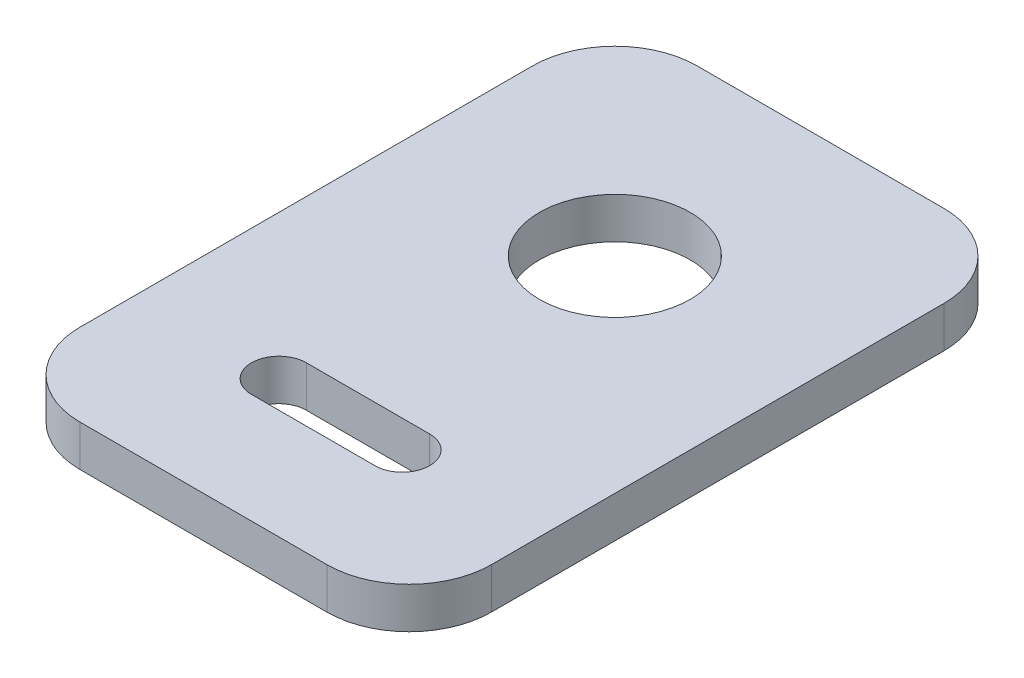
ISO-10303-21;
HEADER;
FILE_DESCRIPTION(('STEP AP214'),'2;1');
FILE_NAME('part.step','',(''),(''),'','','');
FILE_SCHEMA(('AUTOMOTIVE_DESIGN { 1 0 10303 214 1 1 1 1 }'));
ENDSEC;
DATA;
#1=APPLICATION_CONTEXT('core data for automotive mechanical design processes');
#2=APPLICATION_PROTOCOL_DEFINITION('international standard','automotive_design',2000,#1);
#3=PRODUCT_CONTEXT('',#1,'mechanical');
#4=PRODUCT('Part','Part','',(#3));
#5=PRODUCT_RELATED_PRODUCT_CATEGORY('part','',(#4));
#6=PRODUCT_DEFINITION_FORMATION('','',#4);
#7=PRODUCT_DEFINITION_CONTEXT('part definition',#1,'design');
#8=PRODUCT_DEFINITION('design','',#6,#7);
#9=PRODUCT_DEFINITION_SHAPE('','',#8);
#10=(LENGTH_UNIT() NAMED_UNIT(*) SI_UNIT(.MILLI.,.METRE.));
#11=(NAMED_UNIT(*) PLANE_ANGLE_UNIT() SI_UNIT($,.RADIAN.));
#12=(NAMED_UNIT(*) SI_UNIT($,.STERADIAN.) SOLID_ANGLE_UNIT());
#13=UNCERTAINTY_MEASURE_WITH_UNIT(LENGTH_MEASURE(1.E-05),#10,'distance_accuracy_value','');
#14=(GEOMETRIC_REPRESENTATION_CONTEXT(3) GLOBAL_UNCERTAINTY_ASSIGNED_CONTEXT((#13)) GLOBAL_UNIT_ASSIGNED_CONTEXT((#10,
#11,#12)) REPRESENTATION_CONTEXT('',''));
#15=CARTESIAN_POINT('',(0.,0.,0.));
#16=DIRECTION('',(0.,0.,1.));
#17=DIRECTION('',(1.,0.,0.));
#18=AXIS2_PLACEMENT_3D('',#15,#16,#17);
#19=CARTESIAN_POINT('',(0.,1.5,0.));
#20=DIRECTION('',(0.,1.,0.));
#21=DIRECTION('',(0.,0.,1.));
#22=AXIS2_PLACEMENT_3D('',#19,#20,#21);
#23=PLANE('',#22);
#24=DIRECTION('',(1.,0.,0.));
#25=VECTOR('',#24,1.);
#26=CARTESIAN_POINT('',(-2.25,1.5,11.));
#27=LINE('',#26,#25);
#28=CARTESIAN_POINT('',(2.25,1.5,11.));
#29=VERTEX_POINT('',#28);
#30=CARTESIAN_POINT('',(-2.25,1.5,11.));
#31=VERTEX_POINT('',#30);
#32=EDGE_CURVE('E160',#29,#31,#27,.F.);
#33=ORIENTED_EDGE('',*,*,#32,.T.);
#34=CARTESIAN_POINT('',(-2.25,1.5,10.));
#35=DIRECTION('',(0.,1.,0.));
#36=DIRECTION('',(0.,0.,1.));
#37=AXIS2_PLACEMENT_3D('',#34,#35,#36);
#38=CIRCLE('',#37,1.);
#39=CARTESIAN_POINT('',(-2.25,1.5,9.));
#40=VERTEX_POINT('',#39);
#41=EDGE_CURVE('E215',#31,#40,#38,.F.);
#42=ORIENTED_EDGE('',*,*,#41,.T.);
#43=DIRECTION('',(-1.,0.,0.));
#44=VECTOR('',#43,1.);
#45=CARTESIAN_POINT('',(2.25,1.5,9.));
#46=LINE('',#45,#44);
#47=CARTESIAN_POINT('',(2.25,1.5,9.));
#48=VERTEX_POINT('',#47);
#49=EDGE_CURVE('E165',#40,#48,#46,.F.);
#50=ORIENTED_EDGE('',*,*,#49,.T.);
#51=CARTESIAN_POINT('',(2.25,1.5,10.));
#52=DIRECTION('',(0.,1.,0.));
#53=DIRECTION('',(0.,0.,1.));
#54=AXIS2_PLACEMENT_3D('',#51,#52,#53);
#55=CIRCLE('',#54,1.);
#56=EDGE_CURVE('E212',#48,#29,#55,.F.);
#57=ORIENTED_EDGE('',*,*,#56,.T.);
#58=EDGE_LOOP('',(#33,#42,#50,#57));
#59=FACE_BOUND('',#58,.T.);
#60=CARTESIAN_POINT('',(0.,1.5,0.));
#61=DIRECTION('',(0.,1.,0.));
#62=DIRECTION('',(0.,0.,1.));
#63=AXIS2_PLACEMENT_3D('',#60,#61,#62);
#64=CIRCLE('',#63,2.75);
#65=CARTESIAN_POINT('',(0.,1.5,2.75));
#66=VERTEX_POINT('',#65);
#67=EDGE_CURVE('E218',#66,#66,#64,.F.);
#68=ORIENTED_EDGE('',*,*,#67,.T.);
#69=EDGE_LOOP('',(#68));
#70=FACE_BOUND('',#69,.T.);
#71=DIRECTION('',(1.,0.,0.));
#72=VECTOR('',#71,1.);
#73=CARTESIAN_POINT('',(-7.5,1.5,15.));
#74=LINE('',#73,#72);
#75=CARTESIAN_POINT('',(4.5,1.5,15.));
#76=VERTEX_POINT('',#75);
#77=CARTESIAN_POINT('',(-4.5,1.5,15.));
#78=VERTEX_POINT('',#77);
#79=EDGE_CURVE('E143',#76,#78,#74,.F.);
#80=ORIENTED_EDGE('',*,*,#79,.F.);
#81=CARTESIAN_POINT('',(4.5,1.5,12.));
#82=DIRECTION('',(0.,-1.,0.));
#83=DIRECTION('',(0.,0.,-1.));
#84=AXIS2_PLACEMENT_3D('',#81,#82,#83);
#85=CIRCLE('',#84,3.);
#86=CARTESIAN_POINT('',(7.5,1.5,12.));
#87=VERTEX_POINT('',#86);
#88=EDGE_CURVE('E20',#87,#76,#85,.T.);
#89=ORIENTED_EDGE('',*,*,#88,.F.);
#90=DIRECTION('',(0.,0.,-1.));
#91=VECTOR('',#90,1.);
#92=CARTESIAN_POINT('',(7.5,1.5,15.));
#93=LINE('',#92,#91);
#94=CARTESIAN_POINT('',(7.5,1.5,-4.5));
#95=VERTEX_POINT('',#94);
#96=EDGE_CURVE('E128',#95,#87,#93,.F.);
#97=ORIENTED_EDGE('',*,*,#96,.F.);
#98=CARTESIAN_POINT('',(4.5,1.5,-4.5));
#99=DIRECTION('',(0.,-1.,0.));
#100=DIRECTION('',(0.,0.,-1.));
#101=AXIS2_PLACEMENT_3D('',#98,#99,#100);
#102=CIRCLE('',#101,3.);
#103=CARTESIAN_POINT('',(4.5,1.5,-7.5));
#104=VERTEX_POINT('',#103);
#105=EDGE_CURVE('E152',#104,#95,#102,.T.);
#106=ORIENTED_EDGE('',*,*,#105,.F.);
#107=DIRECTION('',(-1.,0.,0.));
#108=VECTOR('',#107,1.);
#109=CARTESIAN_POINT('',(7.5,1.5,-7.5));
#110=LINE('',#109,#108);
#111=CARTESIAN_POINT('',(-4.5,1.5,-7.5));
#112=VERTEX_POINT('',#111);
#113=EDGE_CURVE('E179',#112,#104,#110,.F.);
#114=ORIENTED_EDGE('',*,*,#113,.F.);
#115=CARTESIAN_POINT('',(-4.5,1.5,-4.5));
#116=DIRECTION('',(0.,-1.,0.));
#117=DIRECTION('',(0.,0.,-1.));
#118=AXIS2_PLACEMENT_3D('',#115,#116,#117);
#119=CIRCLE('',#118,3.);
#120=CARTESIAN_POINT('',(-7.5,1.5,-4.5));
#121=VERTEX_POINT('',#120);
#122=EDGE_CURVE('E226',#121,#112,#119,.T.);
#123=ORIENTED_EDGE('',*,*,#122,.F.);
#124=DIRECTION('',(0.,0.,1.));
#125=VECTOR('',#124,1.);
#126=CARTESIAN_POINT('',(-7.5,1.5,-7.5));
#127=LINE('',#126,#125);
#128=CARTESIAN_POINT('',(-7.5,1.5,12.));
#129=VERTEX_POINT('',#128);
#130=EDGE_CURVE('E174',#129,#121,#127,.F.);
#131=ORIENTED_EDGE('',*,*,#130,.F.);
#132=CARTESIAN_POINT('',(-4.5,1.5,12.));
#133=DIRECTION('',(0.,-1.,0.));
#134=DIRECTION('',(0.,0.,-1.));
#135=AXIS2_PLACEMENT_3D('',#132,#133,#134);
#136=CIRCLE('',#135,3.);
#137=EDGE_CURVE('E223',#78,#129,#136,.T.);
#138=ORIENTED_EDGE('',*,*,#137,.F.);
#139=EDGE_LOOP('',(#80,#89,#97,#106,#114,#123,#131,#138));
#140=FACE_BOUND('',#139,.T.);
#141=ADVANCED_FACE('F17',(#59,#70,#140),#23,.T.);
#142=CARTESIAN_POINT('',(4.5,5.259,12.));
#143=DIRECTION('',(0.,-1.,0.));
#144=DIRECTION('',(0.,0.,-1.));
#145=AXIS2_PLACEMENT_3D('',#142,#143,#144);
#146=CYLINDRICAL_SURFACE('',#145,3.);
#147=DIRECTION('',(0.,1.,0.));
#148=VECTOR('',#147,1.);
#149=CARTESIAN_POINT('',(4.5,0.,15.));
#150=LINE('',#149,#148);
#151=CARTESIAN_POINT('',(4.5,0.,15.));
#152=VERTEX_POINT('',#151);
#153=EDGE_CURVE('E222',#152,#76,#150,.T.);
#154=ORIENTED_EDGE('',*,*,#153,.F.);
#155=CARTESIAN_POINT('',(4.5,0.,12.));
#156=DIRECTION('',(0.,-1.,0.));
#157=DIRECTION('',(0.,0.,-1.));
#158=AXIS2_PLACEMENT_3D('',#155,#156,#157);
#159=CIRCLE('',#158,3.);
#160=CARTESIAN_POINT('',(7.5,0.,12.));
#161=VERTEX_POINT('',#160);
#162=EDGE_CURVE('E150',#152,#161,#159,.F.);
#163=ORIENTED_EDGE('',*,*,#162,.T.);
#164=DIRECTION('',(0.,1.,0.));
#165=VECTOR('',#164,1.);
#166=CARTESIAN_POINT('',(7.5,0.,12.));
#167=LINE('',#166,#165);
#168=EDGE_CURVE('E133',#87,#161,#167,.F.);
#169=ORIENTED_EDGE('',*,*,#168,.F.);
#170=ORIENTED_EDGE('',*,*,#88,.T.);
#171=EDGE_LOOP('',(#154,#163,#169,#170));
#172=FACE_BOUND('',#171,.T.);
#173=ADVANCED_FACE('F149',(#172),#146,.T.);
#174=CARTESIAN_POINT('',(7.5,0.,15.));
#175=DIRECTION('',(1.,0.,0.));
#176=DIRECTION('',(0.,0.,-1.));
#177=AXIS2_PLACEMENT_3D('',#174,#175,#176);
#178=PLANE('',#177);
#179=ORIENTED_EDGE('',*,*,#96,.T.);
#180=ORIENTED_EDGE('',*,*,#168,.T.);
#181=DIRECTION('',(0.,0.,1.));
#182=VECTOR('',#181,1.);
#183=CARTESIAN_POINT('',(7.5,0.,0.));
#184=LINE('',#183,#182);
#185=CARTESIAN_POINT('',(7.5,0.,-4.5));
#186=VERTEX_POINT('',#185);
#187=EDGE_CURVE('E209',#161,#186,#184,.F.);
#188=ORIENTED_EDGE('',*,*,#187,.T.);
#189=DIRECTION('',(0.,-1.,0.));
#190=VECTOR('',#189,1.);
#191=CARTESIAN_POINT('',(7.5,5.259,-4.5));
#192=LINE('',#191,#190);
#193=EDGE_CURVE('E135',#95,#186,#192,.T.);
#194=ORIENTED_EDGE('',*,*,#193,.F.);
#195=EDGE_LOOP('',(#179,#180,#188,#194));
#196=FACE_BOUND('',#195,.T.);
#197=ADVANCED_FACE('F130',(#196),#178,.T.);
#198=CARTESIAN_POINT('',(4.5,5.259,-4.5));
#199=DIRECTION('',(0.,-1.,0.));
#200=DIRECTION('',(0.,0.,-1.));
#201=AXIS2_PLACEMENT_3D('',#198,#199,#200);
#202=CYLINDRICAL_SURFACE('',#201,3.);
#203=ORIENTED_EDGE('',*,*,#193,.T.);
#204=CARTESIAN_POINT('',(4.5,0.,-4.5));
#205=DIRECTION('',(0.,-1.,0.));
#206=DIRECTION('',(0.,0.,-1.));
#207=AXIS2_PLACEMENT_3D('',#204,#205,#206);
#208=CIRCLE('',#207,3.);
#209=CARTESIAN_POINT('',(4.5,0.,-7.5));
#210=VERTEX_POINT('',#209);
#211=EDGE_CURVE('E205',#186,#210,#208,.F.);
#212=ORIENTED_EDGE('',*,*,#211,.T.);
#213=DIRECTION('',(0.,1.,0.));
#214=VECTOR('',#213,1.);
#215=CARTESIAN_POINT('',(4.5,0.,-7.5));
#216=LINE('',#215,#214);
#217=EDGE_CURVE('E181',#104,#210,#216,.F.);
#218=ORIENTED_EDGE('',*,*,#217,.F.);
#219=ORIENTED_EDGE('',*,*,#105,.T.);
#220=EDGE_LOOP('',(#203,#212,#218,#219));
#221=FACE_BOUND('',#220,.T.);
#222=ADVANCED_FACE('F315',(#221),#202,.T.);
#223=CARTESIAN_POINT('',(7.5,0.,-7.5));
#224=DIRECTION('',(0.,0.,-1.));
#225=DIRECTION('',(-1.,0.,0.));
#226=AXIS2_PLACEMENT_3D('',#223,#224,#225);
#227=PLANE('',#226);
#228=ORIENTED_EDGE('',*,*,#113,.T.);
#229=ORIENTED_EDGE('',*,*,#217,.T.);
#230=DIRECTION('',(1.,0.,0.));
#231=VECTOR('',#230,1.);
#232=CARTESIAN_POINT('',(0.,0.,-7.5));
#233=LINE('',#232,#231);
#234=CARTESIAN_POINT('',(-4.5,0.,-7.5));
#235=VERTEX_POINT('',#234);
#236=EDGE_CURVE('E204',#210,#235,#233,.F.);
#237=ORIENTED_EDGE('',*,*,#236,.T.);
#238=DIRECTION('',(0.,-1.,0.));
#239=VECTOR('',#238,1.);
#240=CARTESIAN_POINT('',(-4.5,5.259,-7.5));
#241=LINE('',#240,#239);
#242=EDGE_CURVE('E178',#112,#235,#241,.T.);
#243=ORIENTED_EDGE('',*,*,#242,.F.);
#244=EDGE_LOOP('',(#228,#229,#237,#243));
#245=FACE_BOUND('',#244,.T.);
#246=ADVANCED_FACE('F313',(#245),#227,.T.);
#247=CARTESIAN_POINT('',(-4.5,5.259,-4.5));
#248=DIRECTION('',(0.,-1.,0.));
#249=DIRECTION('',(0.,0.,-1.));
#250=AXIS2_PLACEMENT_3D('',#247,#248,#249);
#251=CYLINDRICAL_SURFACE('',#250,3.);
#252=ORIENTED_EDGE('',*,*,#242,.T.);
#253=CARTESIAN_POINT('',(-4.5,0.,-4.5));
#254=DIRECTION('',(0.,-1.,0.));
#255=DIRECTION('',(0.,0.,-1.));
#256=AXIS2_PLACEMENT_3D('',#253,#254,#255);
#257=CIRCLE('',#256,3.);
#258=CARTESIAN_POINT('',(-7.5,0.,-4.5));
#259=VERTEX_POINT('',#258);
#260=EDGE_CURVE('E200',#235,#259,#257,.F.);
#261=ORIENTED_EDGE('',*,*,#260,.T.);
#262=DIRECTION('',(0.,1.,0.));
#263=VECTOR('',#262,1.);
#264=CARTESIAN_POINT('',(-7.5,0.,-4.5));
#265=LINE('',#264,#263);
#266=EDGE_CURVE('E177',#121,#259,#265,.F.);
#267=ORIENTED_EDGE('',*,*,#266,.F.);
#268=ORIENTED_EDGE('',*,*,#122,.T.);
#269=EDGE_LOOP('',(#252,#261,#267,#268));
#270=FACE_BOUND('',#269,.T.);
#271=ADVANCED_FACE('F310',(#270),#251,.T.);
#272=CARTESIAN_POINT('',(-7.5,0.,-7.5));
#273=DIRECTION('',(-1.,0.,0.));
#274=DIRECTION('',(0.,0.,1.));
#275=AXIS2_PLACEMENT_3D('',#272,#273,#274);
#276=PLANE('',#275);
#277=ORIENTED_EDGE('',*,*,#130,.T.);
#278=ORIENTED_EDGE('',*,*,#266,.T.);
#279=DIRECTION('',(0.,0.,1.));
#280=VECTOR('',#279,1.);
#281=CARTESIAN_POINT('',(-7.5,0.,0.));
#282=LINE('',#281,#280);
#283=CARTESIAN_POINT('',(-7.5,0.,12.));
#284=VERTEX_POINT('',#283);
#285=EDGE_CURVE('E199',#259,#284,#282,.T.);
#286=ORIENTED_EDGE('',*,*,#285,.T.);
#287=DIRECTION('',(0.,-1.,0.));
#288=VECTOR('',#287,1.);
#289=CARTESIAN_POINT('',(-7.5,5.259,12.));
#290=LINE('',#289,#288);
#291=EDGE_CURVE('E173',#129,#284,#290,.T.);
#292=ORIENTED_EDGE('',*,*,#291,.F.);
#293=EDGE_LOOP('',(#277,#278,#286,#292));
#294=FACE_BOUND('',#293,.T.);
#295=ADVANCED_FACE('F308',(#294),#276,.T.);
#296=CARTESIAN_POINT('',(-4.5,5.259,12.));
#297=DIRECTION('',(0.,-1.,0.));
#298=DIRECTION('',(0.,0.,-1.));
#299=AXIS2_PLACEMENT_3D('',#296,#297,#298);
#300=CYLINDRICAL_SURFACE('',#299,3.);
#301=ORIENTED_EDGE('',*,*,#291,.T.);
#302=CARTESIAN_POINT('',(-4.5,0.,12.));
#303=DIRECTION('',(0.,-1.,0.));
#304=DIRECTION('',(0.,0.,-1.));
#305=AXIS2_PLACEMENT_3D('',#302,#303,#304);
#306=CIRCLE('',#305,3.);
#307=CARTESIAN_POINT('',(-4.5,0.,15.));
#308=VERTEX_POINT('',#307);
#309=EDGE_CURVE('E195',#284,#308,#306,.F.);
#310=ORIENTED_EDGE('',*,*,#309,.T.);
#311=DIRECTION('',(0.,1.,0.));
#312=VECTOR('',#311,1.);
#313=CARTESIAN_POINT('',(-4.5,0.,15.));
#314=LINE('',#313,#312);
#315=EDGE_CURVE('E172',#78,#308,#314,.F.);
#316=ORIENTED_EDGE('',*,*,#315,.F.);
#317=ORIENTED_EDGE('',*,*,#137,.T.);
#318=EDGE_LOOP('',(#301,#310,#316,#317));
#319=FACE_BOUND('',#318,.T.);
#320=ADVANCED_FACE('F317',(#319),#300,.T.);
#321=CARTESIAN_POINT('',(-7.5,0.,15.));
#322=DIRECTION('',(0.,0.,1.));
#323=DIRECTION('',(1.,0.,0.));
#324=AXIS2_PLACEMENT_3D('',#321,#322,#323);
#325=PLANE('',#324);
#326=DIRECTION('',(1.,0.,0.));
#327=VECTOR('',#326,1.);
#328=CARTESIAN_POINT('',(0.,0.,15.));
#329=LINE('',#328,#327);
#330=EDGE_CURVE('E194',#308,#152,#329,.T.);
#331=ORIENTED_EDGE('',*,*,#330,.T.);
#332=ORIENTED_EDGE('',*,*,#153,.T.);
#333=ORIENTED_EDGE('',*,*,#79,.T.);
#334=ORIENTED_EDGE('',*,*,#315,.T.);
#335=EDGE_LOOP('',(#331,#332,#333,#334));
#336=FACE_BOUND('',#335,.T.);
#337=ADVANCED_FACE('F294',(#336),#325,.T.);
#338=CARTESIAN_POINT('',(0.,0.,0.));
#339=DIRECTION('',(0.,1.,0.));
#340=DIRECTION('',(0.,0.,1.));
#341=AXIS2_PLACEMENT_3D('',#338,#339,#340);
#342=CYLINDRICAL_SURFACE('',#341,2.75);
#343=ORIENTED_EDGE('',*,*,#67,.F.);
#344=EDGE_LOOP('',(#343));
#345=FACE_BOUND('',#344,.T.);
#346=CARTESIAN_POINT('',(0.,0.,0.));
#347=DIRECTION('',(0.,1.,0.));
#348=DIRECTION('',(0.,0.,1.));
#349=AXIS2_PLACEMENT_3D('',#346,#347,#348);
#350=CIRCLE('',#349,2.75);
#351=CARTESIAN_POINT('',(0.,0.,2.75));
#352=VERTEX_POINT('',#351);
#353=EDGE_CURVE('E190',#352,#352,#350,.F.);
#354=ORIENTED_EDGE('',*,*,#353,.T.);
#355=EDGE_LOOP('',(#354));
#356=FACE_BOUND('',#355,.T.);
#357=ADVANCED_FACE('F291',(#345,#356),#342,.F.);
#358=CARTESIAN_POINT('',(-2.25,1.5,10.));
#359=DIRECTION('',(0.,1.,0.));
#360=DIRECTION('',(0.,0.,1.));
#361=AXIS2_PLACEMENT_3D('',#358,#359,#360);
#362=CYLINDRICAL_SURFACE('',#361,1.);
#363=ORIENTED_EDGE('',*,*,#41,.F.);
#364=DIRECTION('',(0.,1.,0.));
#365=VECTOR('',#364,1.);
#366=CARTESIAN_POINT('',(-2.25,1.5,11.));
#367=LINE('',#366,#365);
#368=CARTESIAN_POINT('',(-2.25,0.,11.));
#369=VERTEX_POINT('',#368);
#370=EDGE_CURVE('E164',#31,#369,#367,.F.);
#371=ORIENTED_EDGE('',*,*,#370,.T.);
#372=CARTESIAN_POINT('',(-2.25,0.,10.));
#373=DIRECTION('',(0.,1.,0.));
#374=DIRECTION('',(0.,0.,1.));
#375=AXIS2_PLACEMENT_3D('',#372,#373,#374);
#376=CIRCLE('',#375,1.);
#377=CARTESIAN_POINT('',(-2.25,0.,9.));
#378=VERTEX_POINT('',#377);
#379=EDGE_CURVE('E186',#369,#378,#376,.F.);
#380=ORIENTED_EDGE('',*,*,#379,.T.);
#381=DIRECTION('',(0.,1.,0.));
#382=VECTOR('',#381,1.);
#383=CARTESIAN_POINT('',(-2.25,1.5,9.));
#384=LINE('',#383,#382);
#385=EDGE_CURVE('E169',#378,#40,#384,.T.);
#386=ORIENTED_EDGE('',*,*,#385,.T.);
#387=EDGE_LOOP('',(#363,#371,#380,#386));
#388=FACE_BOUND('',#387,.T.);
#389=ADVANCED_FACE('F280',(#388),#362,.F.);
#390=CARTESIAN_POINT('',(2.25,1.5,9.));
#391=DIRECTION('',(0.,0.,-1.));
#392=DIRECTION('',(-1.,0.,0.));
#393=AXIS2_PLACEMENT_3D('',#390,#391,#392);
#394=PLANE('',#393);
#395=ORIENTED_EDGE('',*,*,#49,.F.);
#396=ORIENTED_EDGE('',*,*,#385,.F.);
#397=DIRECTION('',(1.,0.,0.));
#398=VECTOR('',#397,1.);
#399=CARTESIAN_POINT('',(0.,0.,9.));
#400=LINE('',#399,#398);
#401=CARTESIAN_POINT('',(2.25,0.,9.));
#402=VERTEX_POINT('',#401);
#403=EDGE_CURVE('E185',#378,#402,#400,.T.);
#404=ORIENTED_EDGE('',*,*,#403,.T.);
#405=DIRECTION('',(0.,1.,0.));
#406=VECTOR('',#405,1.);
#407=CARTESIAN_POINT('',(2.25,1.5,9.));
#408=LINE('',#407,#406);
#409=EDGE_CURVE('E168',#402,#48,#408,.T.);
#410=ORIENTED_EDGE('',*,*,#409,.T.);
#411=EDGE_LOOP('',(#395,#396,#404,#410));
#412=FACE_BOUND('',#411,.T.);
#413=ADVANCED_FACE('F274',(#412),#394,.F.);
#414=CARTESIAN_POINT('',(2.25,1.5,10.));
#415=DIRECTION('',(0.,1.,0.));
#416=DIRECTION('',(0.,0.,1.));
#417=AXIS2_PLACEMENT_3D('',#414,#415,#416);
#418=CYLINDRICAL_SURFACE('',#417,1.);
#419=ORIENTED_EDGE('',*,*,#56,.F.);
#420=ORIENTED_EDGE('',*,*,#409,.F.);
#421=CARTESIAN_POINT('',(2.25,0.,10.));
#422=DIRECTION('',(0.,1.,0.));
#423=DIRECTION('',(0.,0.,1.));
#424=AXIS2_PLACEMENT_3D('',#421,#422,#423);
#425=CIRCLE('',#424,1.);
#426=CARTESIAN_POINT('',(2.25,0.,11.));
#427=VERTEX_POINT('',#426);
#428=EDGE_CURVE('E27',#402,#427,#425,.F.);
#429=ORIENTED_EDGE('',*,*,#428,.T.);
#430=DIRECTION('',(0.,1.,0.));
#431=VECTOR('',#430,1.);
#432=CARTESIAN_POINT('',(2.25,1.5,11.));
#433=LINE('',#432,#431);
#434=EDGE_CURVE('E39',#427,#29,#433,.T.);
#435=ORIENTED_EDGE('',*,*,#434,.T.);
#436=EDGE_LOOP('',(#419,#420,#429,#435));
#437=FACE_BOUND('',#436,.T.);
#438=ADVANCED_FACE('F285',(#437),#418,.F.);
#439=CARTESIAN_POINT('',(-2.25,1.5,11.));
#440=DIRECTION('',(0.,0.,1.));
#441=DIRECTION('',(1.,0.,0.));
#442=AXIS2_PLACEMENT_3D('',#439,#440,#441);
#443=PLANE('',#442);
#444=ORIENTED_EDGE('',*,*,#32,.F.);
#445=ORIENTED_EDGE('',*,*,#434,.F.);
#446=DIRECTION('',(1.,0.,0.));
#447=VECTOR('',#446,1.);
#448=CARTESIAN_POINT('',(0.,0.,11.));
#449=LINE('',#448,#447);
#450=EDGE_CURVE('E11',#427,#369,#449,.F.);
#451=ORIENTED_EDGE('',*,*,#450,.T.);
#452=ORIENTED_EDGE('',*,*,#370,.F.);
#453=EDGE_LOOP('',(#444,#445,#451,#452));
#454=FACE_BOUND('',#453,.T.);
#455=ADVANCED_FACE('F282',(#454),#443,.F.);
#456=CARTESIAN_POINT('',(0.,0.,0.));
#457=DIRECTION('',(0.,1.,0.));
#458=DIRECTION('',(0.,0.,1.));
#459=AXIS2_PLACEMENT_3D('',#456,#457,#458);
#460=PLANE('',#459);
#461=ORIENTED_EDGE('',*,*,#428,.F.);
#462=ORIENTED_EDGE('',*,*,#403,.F.);
#463=ORIENTED_EDGE('',*,*,#379,.F.);
#464=ORIENTED_EDGE('',*,*,#450,.F.);
#465=EDGE_LOOP('',(#461,#462,#463,#464));
#466=FACE_BOUND('',#465,.T.);
#467=ORIENTED_EDGE('',*,*,#353,.F.);
#468=EDGE_LOOP('',(#467));
#469=FACE_BOUND('',#468,.T.);
#470=ORIENTED_EDGE('',*,*,#309,.F.);
#471=ORIENTED_EDGE('',*,*,#285,.F.);
#472=ORIENTED_EDGE('',*,*,#260,.F.);
#473=ORIENTED_EDGE('',*,*,#236,.F.);
#474=ORIENTED_EDGE('',*,*,#211,.F.);
#475=ORIENTED_EDGE('',*,*,#187,.F.);
#476=ORIENTED_EDGE('',*,*,#162,.F.);
#477=ORIENTED_EDGE('',*,*,#330,.F.);
#478=EDGE_LOOP('',(#470,#471,#472,#473,#474,#475,#476,#477));
#479=FACE_BOUND('',#478,.T.);
#480=ADVANCED_FACE('F277',(#466,#469,#479),#460,.F.);
#481=CLOSED_SHELL('',(#141,#173,#197,#222,#246,#271,#295,#320,#337,#357,#389,#413,#438,#455,#480));
#482=MANIFOLD_SOLID_BREP('B1',#481);
#483=ADVANCED_BREP_SHAPE_REPRESENTATION('',(#18,#482),#14);
#484=SHAPE_DEFINITION_REPRESENTATION(#9,#483);
ENDSEC;
END-ISO-10303-21;
